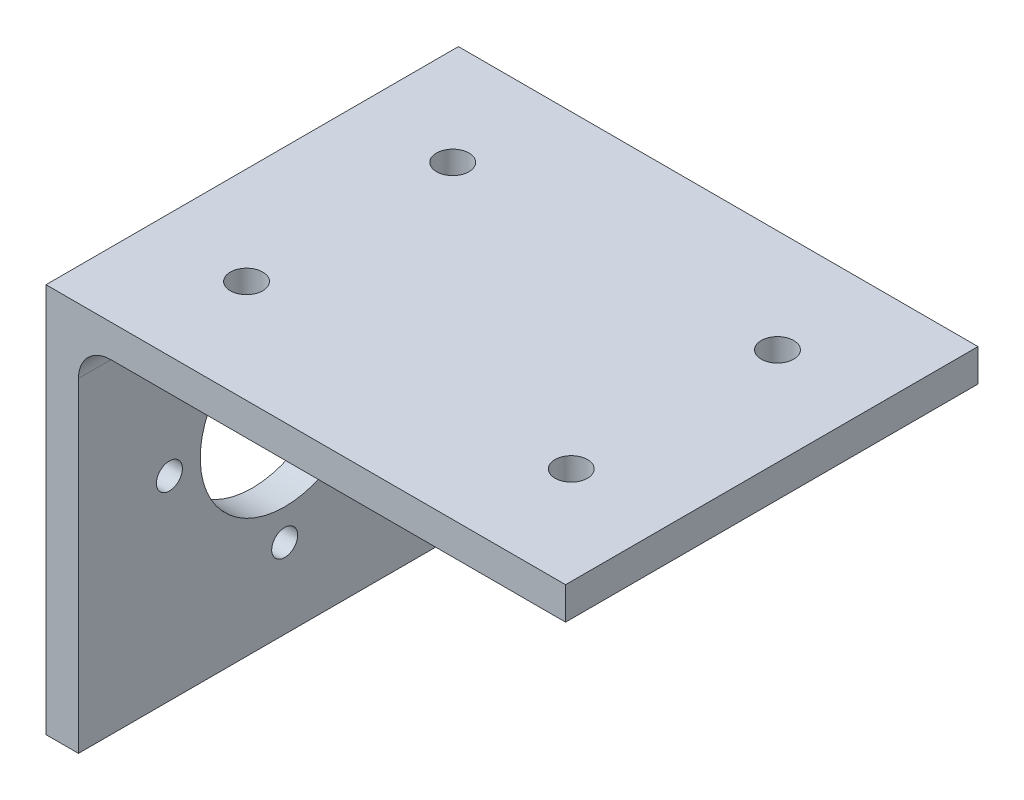
ISO-10303-21;
HEADER;
FILE_DESCRIPTION(('STEP AP214'),'2;1');
FILE_NAME('part.step','',(''),(''),'','','');
FILE_SCHEMA(('AUTOMOTIVE_DESIGN { 1 0 10303 214 1 1 1 1 }'));
ENDSEC;
DATA;
#1=APPLICATION_CONTEXT('core data for automotive mechanical design processes');
#2=APPLICATION_PROTOCOL_DEFINITION('international standard','automotive_design',2000,#1);
#3=PRODUCT_CONTEXT('',#1,'mechanical');
#4=PRODUCT('Part','Part','',(#3));
#5=PRODUCT_RELATED_PRODUCT_CATEGORY('part','',(#4));
#6=PRODUCT_DEFINITION_FORMATION('','',#4);
#7=PRODUCT_DEFINITION_CONTEXT('part definition',#1,'design');
#8=PRODUCT_DEFINITION('design','',#6,#7);
#9=PRODUCT_DEFINITION_SHAPE('','',#8);
#10=(LENGTH_UNIT() NAMED_UNIT(*) SI_UNIT(.MILLI.,.METRE.));
#11=(NAMED_UNIT(*) PLANE_ANGLE_UNIT() SI_UNIT($,.RADIAN.));
#12=(NAMED_UNIT(*) SI_UNIT($,.STERADIAN.) SOLID_ANGLE_UNIT());
#13=UNCERTAINTY_MEASURE_WITH_UNIT(LENGTH_MEASURE(1.E-05),#10,'distance_accuracy_value','');
#14=(GEOMETRIC_REPRESENTATION_CONTEXT(3) GLOBAL_UNCERTAINTY_ASSIGNED_CONTEXT((#13)) GLOBAL_UNIT_ASSIGNED_CONTEXT((#10,
#11,#12)) REPRESENTATION_CONTEXT('',''));
#15=CARTESIAN_POINT('',(0.,0.,0.));
#16=DIRECTION('',(0.,0.,1.));
#17=DIRECTION('',(1.,0.,0.));
#18=AXIS2_PLACEMENT_3D('',#15,#16,#17);
#19=CARTESIAN_POINT('',(5.,0.,63.5));
#20=DIRECTION('',(0.,1.,0.));
#21=DIRECTION('',(0.,0.,1.));
#22=AXIS2_PLACEMENT_3D('',#19,#20,#21);
#23=PLANE('',#22);
#24=DIRECTION('',(1.,0.,0.));
#25=VECTOR('',#24,1.);
#26=CARTESIAN_POINT('',(5.,0.,0.));
#27=LINE('',#26,#25);
#28=CARTESIAN_POINT('',(0.,0.,0.));
#29=VERTEX_POINT('',#28);
#30=CARTESIAN_POINT('',(5.,0.,0.));
#31=VERTEX_POINT('',#30);
#32=EDGE_CURVE('E123',#29,#31,#27,.T.);
#33=ORIENTED_EDGE('',*,*,#32,.T.);
#34=DIRECTION('',(0.,0.,-1.));
#35=VECTOR('',#34,1.);
#36=CARTESIAN_POINT('',(5.,0.,63.5));
#37=LINE('',#36,#35);
#38=CARTESIAN_POINT('',(5.,0.,63.5));
#39=VERTEX_POINT('',#38);
#40=EDGE_CURVE('E11',#39,#31,#37,.T.);
#41=ORIENTED_EDGE('',*,*,#40,.F.);
#42=DIRECTION('',(1.,0.,0.));
#43=VECTOR('',#42,1.);
#44=CARTESIAN_POINT('',(5.,0.,63.5));
#45=LINE('',#44,#43);
#46=CARTESIAN_POINT('',(0.,0.,63.5));
#47=VERTEX_POINT('',#46);
#48=EDGE_CURVE('E136',#47,#39,#45,.T.);
#49=ORIENTED_EDGE('',*,*,#48,.F.);
#50=DIRECTION('',(0.,0.,-1.));
#51=VECTOR('',#50,1.);
#52=CARTESIAN_POINT('',(0.,0.,63.5));
#53=LINE('',#52,#51);
#54=EDGE_CURVE('E119',#47,#29,#53,.T.);
#55=ORIENTED_EDGE('',*,*,#54,.T.);
#56=EDGE_LOOP('',(#33,#41,#49,#55));
#57=FACE_BOUND('',#56,.T.);
#58=ADVANCED_FACE('F33',(#57),#23,.F.);
#59=CARTESIAN_POINT('',(4.99999999999999,50.,63.5));
#60=DIRECTION('',(-1.,0.,0.));
#61=DIRECTION('',(0.,-1.,0.));
#62=AXIS2_PLACEMENT_3D('',#59,#60,#61);
#63=PLANE('',#62);
#64=CARTESIAN_POINT('',(5.,30.,49.5));
#65=DIRECTION('',(-1.,0.,0.));
#66=DIRECTION('',(0.,-1.,0.));
#67=AXIS2_PLACEMENT_3D('',#64,#65,#66);
#68=CIRCLE('',#67,2.);
#69=CARTESIAN_POINT('',(5.,28.,49.5));
#70=VERTEX_POINT('',#69);
#71=EDGE_CURVE('E162',#70,#70,#68,.T.);
#72=ORIENTED_EDGE('',*,*,#71,.T.);
#73=EDGE_LOOP('',(#72));
#74=FACE_BOUND('',#73,.T.);
#75=CARTESIAN_POINT('',(5.,12.25,31.75));
#76=DIRECTION('',(-1.,0.,0.));
#77=DIRECTION('',(0.,-1.,0.));
#78=AXIS2_PLACEMENT_3D('',#75,#76,#77);
#79=CIRCLE('',#78,2.00000000000001);
#80=CARTESIAN_POINT('',(5.,10.25,31.75));
#81=VERTEX_POINT('',#80);
#82=EDGE_CURVE('E168',#81,#81,#79,.T.);
#83=ORIENTED_EDGE('',*,*,#82,.T.);
#84=EDGE_LOOP('',(#83));
#85=FACE_BOUND('',#84,.T.);
#86=CARTESIAN_POINT('',(5.,30.,14.));
#87=DIRECTION('',(-1.,0.,0.));
#88=DIRECTION('',(0.,-1.,0.));
#89=AXIS2_PLACEMENT_3D('',#86,#87,#88);
#90=CIRCLE('',#89,2.00000000000001);
#91=CARTESIAN_POINT('',(5.,28.,14.));
#92=VERTEX_POINT('',#91);
#93=EDGE_CURVE('E169',#92,#92,#90,.T.);
#94=ORIENTED_EDGE('',*,*,#93,.T.);
#95=EDGE_LOOP('',(#94));
#96=FACE_BOUND('',#95,.T.);
#97=CARTESIAN_POINT('',(4.99999999999999,47.75,31.75));
#98=DIRECTION('',(-1.,0.,0.));
#99=DIRECTION('',(0.,-1.,0.));
#100=AXIS2_PLACEMENT_3D('',#97,#98,#99);
#101=CIRCLE('',#100,2.);
#102=CARTESIAN_POINT('',(4.99999999999999,45.75,31.75));
#103=VERTEX_POINT('',#102);
#104=EDGE_CURVE('E180',#103,#103,#101,.T.);
#105=ORIENTED_EDGE('',*,*,#104,.T.);
#106=EDGE_LOOP('',(#105));
#107=FACE_BOUND('',#106,.T.);
#108=CARTESIAN_POINT('',(5.,30.,31.75));
#109=DIRECTION('',(-1.,0.,0.));
#110=DIRECTION('',(0.,-1.,0.));
#111=AXIS2_PLACEMENT_3D('',#108,#109,#110);
#112=CIRCLE('',#111,13.);
#113=CARTESIAN_POINT('',(5.,17.,31.75));
#114=VERTEX_POINT('',#113);
#115=EDGE_CURVE('E127',#114,#114,#112,.T.);
#116=ORIENTED_EDGE('',*,*,#115,.T.);
#117=EDGE_LOOP('',(#116));
#118=FACE_BOUND('',#117,.T.);
#119=DIRECTION('',(0.,1.,0.));
#120=VECTOR('',#119,1.);
#121=CARTESIAN_POINT('',(4.99999999999999,50.,0.));
#122=LINE('',#121,#120);
#123=CARTESIAN_POINT('',(4.99999999999999,50.,0.));
#124=VERTEX_POINT('',#123);
#125=EDGE_CURVE('E126',#31,#124,#122,.T.);
#126=ORIENTED_EDGE('',*,*,#125,.T.);
#127=DIRECTION('',(0.,0.,-1.));
#128=VECTOR('',#127,1.);
#129=CARTESIAN_POINT('',(4.99999999999999,50.,63.5));
#130=LINE('',#129,#128);
#131=CARTESIAN_POINT('',(4.99999999999999,50.,63.5));
#132=VERTEX_POINT('',#131);
#133=EDGE_CURVE('E41',#132,#124,#130,.T.);
#134=ORIENTED_EDGE('',*,*,#133,.F.);
#135=DIRECTION('',(0.,1.,0.));
#136=VECTOR('',#135,1.);
#137=CARTESIAN_POINT('',(4.99999999999999,50.,63.5));
#138=LINE('',#137,#136);
#139=EDGE_CURVE('E89',#39,#132,#138,.T.);
#140=ORIENTED_EDGE('',*,*,#139,.F.);
#141=ORIENTED_EDGE('',*,*,#40,.T.);
#142=EDGE_LOOP('',(#126,#134,#140,#141));
#143=FACE_BOUND('',#142,.T.);
#144=ADVANCED_FACE('F244',(#74,#85,#96,#107,#118,#143),#63,.F.);
#145=CARTESIAN_POINT('',(9.99999999999998,50.,63.5));
#146=DIRECTION('',(0.,0.,-1.));
#147=DIRECTION('',(-1.,0.,0.));
#148=AXIS2_PLACEMENT_3D('',#145,#146,#147);
#149=CYLINDRICAL_SURFACE('',#148,4.99999999999999);
#150=CARTESIAN_POINT('',(9.99999999999998,50.,0.));
#151=DIRECTION('',(0.,0.,-1.));
#152=DIRECTION('',(1.,0.,0.));
#153=AXIS2_PLACEMENT_3D('',#150,#151,#152);
#154=CIRCLE('',#153,4.99999999999999);
#155=CARTESIAN_POINT('',(9.99999999999998,55.,0.));
#156=VERTEX_POINT('',#155);
#157=EDGE_CURVE('E129',#124,#156,#154,.T.);
#158=ORIENTED_EDGE('',*,*,#157,.T.);
#159=DIRECTION('',(0.,0.,-1.));
#160=VECTOR('',#159,1.);
#161=CARTESIAN_POINT('',(9.99999999999998,55.,63.5));
#162=LINE('',#161,#160);
#163=CARTESIAN_POINT('',(9.99999999999998,55.,63.5));
#164=VERTEX_POINT('',#163);
#165=EDGE_CURVE('E140',#164,#156,#162,.T.);
#166=ORIENTED_EDGE('',*,*,#165,.F.);
#167=CARTESIAN_POINT('',(9.99999999999998,50.,63.5));
#168=DIRECTION('',(0.,0.,-1.));
#169=DIRECTION('',(1.,0.,0.));
#170=AXIS2_PLACEMENT_3D('',#167,#168,#169);
#171=CIRCLE('',#170,4.99999999999999);
#172=EDGE_CURVE('E148',#132,#164,#171,.T.);
#173=ORIENTED_EDGE('',*,*,#172,.F.);
#174=ORIENTED_EDGE('',*,*,#133,.T.);
#175=EDGE_LOOP('',(#158,#166,#173,#174));
#176=FACE_BOUND('',#175,.T.);
#177=ADVANCED_FACE('F146',(#176),#149,.F.);
#178=CARTESIAN_POINT('',(80.,55.,63.5));
#179=DIRECTION('',(0.,1.,0.));
#180=DIRECTION('',(-1.,0.,0.));
#181=AXIS2_PLACEMENT_3D('',#178,#179,#180);
#182=PLANE('',#181);
#183=CARTESIAN_POINT('',(15.,55.,47.625));
#184=DIRECTION('',(0.,1.,0.));
#185=DIRECTION('',(0.,0.,-1.));
#186=AXIS2_PLACEMENT_3D('',#183,#184,#185);
#187=CIRCLE('',#186,2.5);
#188=CARTESIAN_POINT('',(15.,55.,45.125));
#189=VERTEX_POINT('',#188);
#190=EDGE_CURVE('E198',#189,#189,#187,.T.);
#191=ORIENTED_EDGE('',*,*,#190,.T.);
#192=EDGE_LOOP('',(#191));
#193=FACE_BOUND('',#192,.T.);
#194=CARTESIAN_POINT('',(65.,55.,47.625));
#195=DIRECTION('',(0.,1.,0.));
#196=DIRECTION('',(0.,0.,1.));
#197=AXIS2_PLACEMENT_3D('',#194,#195,#196);
#198=CIRCLE('',#197,2.50000000000001);
#199=CARTESIAN_POINT('',(65.,55.,50.125));
#200=VERTEX_POINT('',#199);
#201=EDGE_CURVE('E204',#200,#200,#198,.T.);
#202=ORIENTED_EDGE('',*,*,#201,.T.);
#203=EDGE_LOOP('',(#202));
#204=FACE_BOUND('',#203,.T.);
#205=CARTESIAN_POINT('',(65.,55.,15.875));
#206=DIRECTION('',(0.,1.,0.));
#207=DIRECTION('',(0.,0.,-1.));
#208=AXIS2_PLACEMENT_3D('',#205,#206,#207);
#209=CIRCLE('',#208,2.49999999999999);
#210=CARTESIAN_POINT('',(65.,55.,13.375));
#211=VERTEX_POINT('',#210);
#212=EDGE_CURVE('E192',#211,#211,#209,.T.);
#213=ORIENTED_EDGE('',*,*,#212,.T.);
#214=EDGE_LOOP('',(#213));
#215=FACE_BOUND('',#214,.T.);
#216=CARTESIAN_POINT('',(15.,55.,15.875));
#217=DIRECTION('',(0.,1.,0.));
#218=DIRECTION('',(0.,0.,1.));
#219=AXIS2_PLACEMENT_3D('',#216,#217,#218);
#220=CIRCLE('',#219,2.5);
#221=CARTESIAN_POINT('',(15.,55.,18.375));
#222=VERTEX_POINT('',#221);
#223=EDGE_CURVE('E181',#222,#222,#220,.T.);
#224=ORIENTED_EDGE('',*,*,#223,.T.);
#225=EDGE_LOOP('',(#224));
#226=FACE_BOUND('',#225,.T.);
#227=DIRECTION('',(1.,0.,0.));
#228=VECTOR('',#227,1.);
#229=CARTESIAN_POINT('',(80.,55.,0.));
#230=LINE('',#229,#228);
#231=CARTESIAN_POINT('',(80.,55.,0.));
#232=VERTEX_POINT('',#231);
#233=EDGE_CURVE('E131',#156,#232,#230,.T.);
#234=ORIENTED_EDGE('',*,*,#233,.T.);
#235=DIRECTION('',(0.,0.,-1.));
#236=VECTOR('',#235,1.);
#237=CARTESIAN_POINT('',(80.,55.,63.5));
#238=LINE('',#237,#236);
#239=CARTESIAN_POINT('',(80.,55.,63.5));
#240=VERTEX_POINT('',#239);
#241=EDGE_CURVE('E114',#240,#232,#238,.T.);
#242=ORIENTED_EDGE('',*,*,#241,.F.);
#243=DIRECTION('',(1.,0.,0.));
#244=VECTOR('',#243,1.);
#245=CARTESIAN_POINT('',(80.,55.,63.5));
#246=LINE('',#245,#244);
#247=EDGE_CURVE('E105',#164,#240,#246,.T.);
#248=ORIENTED_EDGE('',*,*,#247,.F.);
#249=ORIENTED_EDGE('',*,*,#165,.T.);
#250=EDGE_LOOP('',(#234,#242,#248,#249));
#251=FACE_BOUND('',#250,.T.);
#252=ADVANCED_FACE('F154',(#193,#204,#215,#226,#251),#182,.F.);
#253=CARTESIAN_POINT('',(80.,60.,63.5));
#254=DIRECTION('',(-1.,0.,0.));
#255=DIRECTION('',(0.,0.,1.));
#256=AXIS2_PLACEMENT_3D('',#253,#254,#255);
#257=PLANE('',#256);
#258=DIRECTION('',(0.,1.,0.));
#259=VECTOR('',#258,1.);
#260=CARTESIAN_POINT('',(80.,60.,0.));
#261=LINE('',#260,#259);
#262=CARTESIAN_POINT('',(80.,60.,0.));
#263=VERTEX_POINT('',#262);
#264=EDGE_CURVE('E113',#232,#263,#261,.T.);
#265=ORIENTED_EDGE('',*,*,#264,.T.);
#266=DIRECTION('',(0.,0.,-1.));
#267=VECTOR('',#266,1.);
#268=CARTESIAN_POINT('',(80.,60.,63.5));
#269=LINE('',#268,#267);
#270=CARTESIAN_POINT('',(80.,60.,63.5));
#271=VERTEX_POINT('',#270);
#272=EDGE_CURVE('E110',#271,#263,#269,.T.);
#273=ORIENTED_EDGE('',*,*,#272,.F.);
#274=DIRECTION('',(0.,1.,0.));
#275=VECTOR('',#274,1.);
#276=CARTESIAN_POINT('',(80.,60.,63.5));
#277=LINE('',#276,#275);
#278=EDGE_CURVE('E99',#240,#271,#277,.T.);
#279=ORIENTED_EDGE('',*,*,#278,.F.);
#280=ORIENTED_EDGE('',*,*,#241,.T.);
#281=EDGE_LOOP('',(#265,#273,#279,#280));
#282=FACE_BOUND('',#281,.T.);
#283=ADVANCED_FACE('F111',(#282),#257,.F.);
#284=CARTESIAN_POINT('',(0.,60.,63.5));
#285=DIRECTION('',(0.,-1.,0.));
#286=DIRECTION('',(0.,0.,-1.));
#287=AXIS2_PLACEMENT_3D('',#284,#285,#286);
#288=PLANE('',#287);
#289=CARTESIAN_POINT('',(15.,60.,47.625));
#290=DIRECTION('',(0.,1.,0.));
#291=DIRECTION('',(0.,0.,-1.));
#292=AXIS2_PLACEMENT_3D('',#289,#290,#291);
#293=CIRCLE('',#292,2.5);
#294=CARTESIAN_POINT('',(15.,60.,45.125));
#295=VERTEX_POINT('',#294);
#296=EDGE_CURVE('E195',#295,#295,#293,.T.);
#297=ORIENTED_EDGE('',*,*,#296,.F.);
#298=EDGE_LOOP('',(#297));
#299=FACE_BOUND('',#298,.T.);
#300=CARTESIAN_POINT('',(65.,60.,47.625));
#301=DIRECTION('',(0.,1.,0.));
#302=DIRECTION('',(0.,0.,1.));
#303=AXIS2_PLACEMENT_3D('',#300,#301,#302);
#304=CIRCLE('',#303,2.50000000000001);
#305=CARTESIAN_POINT('',(65.,60.,50.125));
#306=VERTEX_POINT('',#305);
#307=EDGE_CURVE('E201',#306,#306,#304,.T.);
#308=ORIENTED_EDGE('',*,*,#307,.F.);
#309=EDGE_LOOP('',(#308));
#310=FACE_BOUND('',#309,.T.);
#311=CARTESIAN_POINT('',(65.,60.,15.875));
#312=DIRECTION('',(0.,1.,0.));
#313=DIRECTION('',(0.,0.,-1.));
#314=AXIS2_PLACEMENT_3D('',#311,#312,#313);
#315=CIRCLE('',#314,2.49999999999999);
#316=CARTESIAN_POINT('',(65.,60.,13.375));
#317=VERTEX_POINT('',#316);
#318=EDGE_CURVE('E207',#317,#317,#315,.T.);
#319=ORIENTED_EDGE('',*,*,#318,.F.);
#320=EDGE_LOOP('',(#319));
#321=FACE_BOUND('',#320,.T.);
#322=CARTESIAN_POINT('',(15.,60.,15.875));
#323=DIRECTION('',(0.,1.,0.));
#324=DIRECTION('',(0.,0.,1.));
#325=AXIS2_PLACEMENT_3D('',#322,#323,#324);
#326=CIRCLE('',#325,2.5);
#327=CARTESIAN_POINT('',(15.,60.,18.375));
#328=VERTEX_POINT('',#327);
#329=EDGE_CURVE('E189',#328,#328,#326,.T.);
#330=ORIENTED_EDGE('',*,*,#329,.F.);
#331=EDGE_LOOP('',(#330));
#332=FACE_BOUND('',#331,.T.);
#333=DIRECTION('',(-1.,0.,0.));
#334=VECTOR('',#333,1.);
#335=CARTESIAN_POINT('',(0.,60.,0.));
#336=LINE('',#335,#334);
#337=CARTESIAN_POINT('',(0.,60.,0.));
#338=VERTEX_POINT('',#337);
#339=EDGE_CURVE('E75',#263,#338,#336,.T.);
#340=ORIENTED_EDGE('',*,*,#339,.T.);
#341=DIRECTION('',(0.,0.,-1.));
#342=VECTOR('',#341,1.);
#343=CARTESIAN_POINT('',(0.,60.,63.5));
#344=LINE('',#343,#342);
#345=CARTESIAN_POINT('',(0.,60.,63.5));
#346=VERTEX_POINT('',#345);
#347=EDGE_CURVE('E115',#346,#338,#344,.T.);
#348=ORIENTED_EDGE('',*,*,#347,.F.);
#349=DIRECTION('',(-1.,0.,0.));
#350=VECTOR('',#349,1.);
#351=CARTESIAN_POINT('',(0.,60.,63.5));
#352=LINE('',#351,#350);
#353=EDGE_CURVE('E103',#271,#346,#352,.T.);
#354=ORIENTED_EDGE('',*,*,#353,.F.);
#355=ORIENTED_EDGE('',*,*,#272,.T.);
#356=EDGE_LOOP('',(#340,#348,#354,#355));
#357=FACE_BOUND('',#356,.T.);
#358=ADVANCED_FACE('F117',(#299,#310,#321,#332,#357),#288,.F.);
#359=CARTESIAN_POINT('',(0.,0.,63.5));
#360=DIRECTION('',(1.,0.,0.));
#361=DIRECTION('',(0.,1.,0.));
#362=AXIS2_PLACEMENT_3D('',#359,#360,#361);
#363=PLANE('',#362);
#364=CARTESIAN_POINT('',(0.,30.,49.5));
#365=DIRECTION('',(-1.,0.,0.));
#366=DIRECTION('',(0.,-1.,0.));
#367=AXIS2_PLACEMENT_3D('',#364,#365,#366);
#368=CIRCLE('',#367,2.);
#369=CARTESIAN_POINT('',(0.,28.,49.5));
#370=VERTEX_POINT('',#369);
#371=EDGE_CURVE('E172',#370,#370,#368,.T.);
#372=ORIENTED_EDGE('',*,*,#371,.F.);
#373=EDGE_LOOP('',(#372));
#374=FACE_BOUND('',#373,.T.);
#375=CARTESIAN_POINT('',(0.,12.25,31.75));
#376=DIRECTION('',(-1.,0.,0.));
#377=DIRECTION('',(0.,-1.,0.));
#378=AXIS2_PLACEMENT_3D('',#375,#376,#377);
#379=CIRCLE('',#378,2.00000000000001);
#380=CARTESIAN_POINT('',(0.,10.25,31.75));
#381=VERTEX_POINT('',#380);
#382=EDGE_CURVE('E165',#381,#381,#379,.T.);
#383=ORIENTED_EDGE('',*,*,#382,.F.);
#384=EDGE_LOOP('',(#383));
#385=FACE_BOUND('',#384,.T.);
#386=CARTESIAN_POINT('',(0.,30.,14.));
#387=DIRECTION('',(-1.,0.,0.));
#388=DIRECTION('',(0.,-1.,0.));
#389=AXIS2_PLACEMENT_3D('',#386,#387,#388);
#390=CIRCLE('',#389,2.00000000000001);
#391=CARTESIAN_POINT('',(0.,28.,14.));
#392=VERTEX_POINT('',#391);
#393=EDGE_CURVE('E184',#392,#392,#390,.T.);
#394=ORIENTED_EDGE('',*,*,#393,.F.);
#395=EDGE_LOOP('',(#394));
#396=FACE_BOUND('',#395,.T.);
#397=CARTESIAN_POINT('',(0.,47.75,31.75));
#398=DIRECTION('',(-1.,0.,0.));
#399=DIRECTION('',(0.,-1.,0.));
#400=AXIS2_PLACEMENT_3D('',#397,#398,#399);
#401=CIRCLE('',#400,2.);
#402=CARTESIAN_POINT('',(0.,45.75,31.75));
#403=VERTEX_POINT('',#402);
#404=EDGE_CURVE('E177',#403,#403,#401,.T.);
#405=ORIENTED_EDGE('',*,*,#404,.F.);
#406=EDGE_LOOP('',(#405));
#407=FACE_BOUND('',#406,.T.);
#408=CARTESIAN_POINT('',(0.,30.,31.75));
#409=DIRECTION('',(-1.,0.,0.));
#410=DIRECTION('',(0.,-1.,0.));
#411=AXIS2_PLACEMENT_3D('',#408,#409,#410);
#412=CIRCLE('',#411,13.);
#413=CARTESIAN_POINT('',(0.,17.,31.75));
#414=VERTEX_POINT('',#413);
#415=EDGE_CURVE('E159',#414,#414,#412,.T.);
#416=ORIENTED_EDGE('',*,*,#415,.F.);
#417=EDGE_LOOP('',(#416));
#418=FACE_BOUND('',#417,.T.);
#419=DIRECTION('',(0.,-1.,0.));
#420=VECTOR('',#419,1.);
#421=CARTESIAN_POINT('',(0.,0.,0.));
#422=LINE('',#421,#420);
#423=EDGE_CURVE('E81',#338,#29,#422,.T.);
#424=ORIENTED_EDGE('',*,*,#423,.T.);
#425=ORIENTED_EDGE('',*,*,#54,.F.);
#426=DIRECTION('',(0.,-1.,0.));
#427=VECTOR('',#426,1.);
#428=CARTESIAN_POINT('',(0.,0.,63.5));
#429=LINE('',#428,#427);
#430=EDGE_CURVE('E49',#346,#47,#429,.T.);
#431=ORIENTED_EDGE('',*,*,#430,.F.);
#432=ORIENTED_EDGE('',*,*,#347,.T.);
#433=EDGE_LOOP('',(#424,#425,#431,#432));
#434=FACE_BOUND('',#433,.T.);
#435=ADVANCED_FACE('F225',(#374,#385,#396,#407,#418,#434),#363,.F.);
#436=CARTESIAN_POINT('',(9.99999999999998,50.,63.5));
#437=DIRECTION('',(0.,0.,1.));
#438=DIRECTION('',(1.,0.,0.));
#439=AXIS2_PLACEMENT_3D('',#436,#437,#438);
#440=PLANE('',#439);
#441=ORIENTED_EDGE('',*,*,#48,.T.);
#442=ORIENTED_EDGE('',*,*,#139,.T.);
#443=ORIENTED_EDGE('',*,*,#172,.T.);
#444=ORIENTED_EDGE('',*,*,#247,.T.);
#445=ORIENTED_EDGE('',*,*,#278,.T.);
#446=ORIENTED_EDGE('',*,*,#353,.T.);
#447=ORIENTED_EDGE('',*,*,#430,.T.);
#448=EDGE_LOOP('',(#441,#442,#443,#444,#445,#446,#447));
#449=FACE_BOUND('',#448,.T.);
#450=ADVANCED_FACE('F101',(#449),#440,.T.);
#451=CARTESIAN_POINT('',(9.99999999999998,50.,0.));
#452=DIRECTION('',(0.,0.,1.));
#453=DIRECTION('',(1.,0.,0.));
#454=AXIS2_PLACEMENT_3D('',#451,#452,#453);
#455=PLANE('',#454);
#456=ORIENTED_EDGE('',*,*,#32,.F.);
#457=ORIENTED_EDGE('',*,*,#423,.F.);
#458=ORIENTED_EDGE('',*,*,#339,.F.);
#459=ORIENTED_EDGE('',*,*,#264,.F.);
#460=ORIENTED_EDGE('',*,*,#233,.F.);
#461=ORIENTED_EDGE('',*,*,#157,.F.);
#462=ORIENTED_EDGE('',*,*,#125,.F.);
#463=EDGE_LOOP('',(#456,#457,#458,#459,#460,#461,#462));
#464=FACE_BOUND('',#463,.T.);
#465=ADVANCED_FACE('F152',(#464),#455,.F.);
#466=CARTESIAN_POINT('',(5.,30.,31.75));
#467=DIRECTION('',(-1.,0.,0.));
#468=DIRECTION('',(0.,-1.,0.));
#469=AXIS2_PLACEMENT_3D('',#466,#467,#468);
#470=CYLINDRICAL_SURFACE('',#469,13.);
#471=ORIENTED_EDGE('',*,*,#115,.F.);
#472=EDGE_LOOP('',(#471));
#473=FACE_BOUND('',#472,.T.);
#474=ORIENTED_EDGE('',*,*,#415,.T.);
#475=EDGE_LOOP('',(#474));
#476=FACE_BOUND('',#475,.T.);
#477=ADVANCED_FACE('F355',(#473,#476),#470,.F.);
#478=CARTESIAN_POINT('',(4.99999999999999,47.75,31.75));
#479=DIRECTION('',(-1.,0.,0.));
#480=DIRECTION('',(0.,-1.,0.));
#481=AXIS2_PLACEMENT_3D('',#478,#479,#480);
#482=CYLINDRICAL_SURFACE('',#481,2.);
#483=ORIENTED_EDGE('',*,*,#104,.F.);
#484=EDGE_LOOP('',(#483));
#485=FACE_BOUND('',#484,.T.);
#486=ORIENTED_EDGE('',*,*,#404,.T.);
#487=EDGE_LOOP('',(#486));
#488=FACE_BOUND('',#487,.T.);
#489=ADVANCED_FACE('F347',(#485,#488),#482,.F.);
#490=CARTESIAN_POINT('',(5.,30.,14.));
#491=DIRECTION('',(-1.,0.,0.));
#492=DIRECTION('',(0.,-1.,0.));
#493=AXIS2_PLACEMENT_3D('',#490,#491,#492);
#494=CYLINDRICAL_SURFACE('',#493,2.00000000000001);
#495=ORIENTED_EDGE('',*,*,#93,.F.);
#496=EDGE_LOOP('',(#495));
#497=FACE_BOUND('',#496,.T.);
#498=ORIENTED_EDGE('',*,*,#393,.T.);
#499=EDGE_LOOP('',(#498));
#500=FACE_BOUND('',#499,.T.);
#501=ADVANCED_FACE('F338',(#497,#500),#494,.F.);
#502=CARTESIAN_POINT('',(5.,12.25,31.75));
#503=DIRECTION('',(-1.,0.,0.));
#504=DIRECTION('',(0.,-1.,0.));
#505=AXIS2_PLACEMENT_3D('',#502,#503,#504);
#506=CYLINDRICAL_SURFACE('',#505,2.00000000000001);
#507=ORIENTED_EDGE('',*,*,#82,.F.);
#508=EDGE_LOOP('',(#507));
#509=FACE_BOUND('',#508,.T.);
#510=ORIENTED_EDGE('',*,*,#382,.T.);
#511=EDGE_LOOP('',(#510));
#512=FACE_BOUND('',#511,.T.);
#513=ADVANCED_FACE('F237',(#509,#512),#506,.F.);
#514=CARTESIAN_POINT('',(5.,30.,49.5));
#515=DIRECTION('',(-1.,0.,0.));
#516=DIRECTION('',(0.,-1.,0.));
#517=AXIS2_PLACEMENT_3D('',#514,#515,#516);
#518=CYLINDRICAL_SURFACE('',#517,2.);
#519=ORIENTED_EDGE('',*,*,#71,.F.);
#520=EDGE_LOOP('',(#519));
#521=FACE_BOUND('',#520,.T.);
#522=ORIENTED_EDGE('',*,*,#371,.T.);
#523=EDGE_LOOP('',(#522));
#524=FACE_BOUND('',#523,.T.);
#525=ADVANCED_FACE('F231',(#521,#524),#518,.F.);
#526=CARTESIAN_POINT('',(15.,55.,15.875));
#527=DIRECTION('',(0.,1.,0.));
#528=DIRECTION('',(0.,0.,1.));
#529=AXIS2_PLACEMENT_3D('',#526,#527,#528);
#530=CYLINDRICAL_SURFACE('',#529,2.5);
#531=ORIENTED_EDGE('',*,*,#223,.F.);
#532=EDGE_LOOP('',(#531));
#533=FACE_BOUND('',#532,.T.);
#534=ORIENTED_EDGE('',*,*,#329,.T.);
#535=EDGE_LOOP('',(#534));
#536=FACE_BOUND('',#535,.T.);
#537=ADVANCED_FACE('F219',(#533,#536),#530,.F.);
#538=CARTESIAN_POINT('',(65.,55.,15.875));
#539=DIRECTION('',(0.,1.,0.));
#540=DIRECTION('',(0.,0.,1.));
#541=AXIS2_PLACEMENT_3D('',#538,#539,#540);
#542=CYLINDRICAL_SURFACE('',#541,2.49999999999999);
#543=ORIENTED_EDGE('',*,*,#212,.F.);
#544=EDGE_LOOP('',(#543));
#545=FACE_BOUND('',#544,.T.);
#546=ORIENTED_EDGE('',*,*,#318,.T.);
#547=EDGE_LOOP('',(#546));
#548=FACE_BOUND('',#547,.T.);
#549=ADVANCED_FACE('F215',(#545,#548),#542,.F.);
#550=CARTESIAN_POINT('',(65.,55.,47.625));
#551=DIRECTION('',(0.,1.,0.));
#552=DIRECTION('',(0.,0.,1.));
#553=AXIS2_PLACEMENT_3D('',#550,#551,#552);
#554=CYLINDRICAL_SURFACE('',#553,2.50000000000001);
#555=ORIENTED_EDGE('',*,*,#201,.F.);
#556=EDGE_LOOP('',(#555));
#557=FACE_BOUND('',#556,.T.);
#558=ORIENTED_EDGE('',*,*,#307,.T.);
#559=EDGE_LOOP('',(#558));
#560=FACE_BOUND('',#559,.T.);
#561=ADVANCED_FACE('F218',(#557,#560),#554,.F.);
#562=CARTESIAN_POINT('',(15.,55.,47.625));
#563=DIRECTION('',(0.,1.,0.));
#564=DIRECTION('',(0.,0.,1.));
#565=AXIS2_PLACEMENT_3D('',#562,#563,#564);
#566=CYLINDRICAL_SURFACE('',#565,2.5);
#567=ORIENTED_EDGE('',*,*,#190,.F.);
#568=EDGE_LOOP('',(#567));
#569=FACE_BOUND('',#568,.T.);
#570=ORIENTED_EDGE('',*,*,#296,.T.);
#571=EDGE_LOOP('',(#570));
#572=FACE_BOUND('',#571,.T.);
#573=ADVANCED_FACE('F308',(#569,#572),#566,.F.);
#574=CLOSED_SHELL('',(#58,#144,#177,#252,#283,#358,#435,#450,#465,#477,#489,#501,#513,#525,#537,
#549,#561,#573));
#575=MANIFOLD_SOLID_BREP('B2',#574);
#576=ADVANCED_BREP_SHAPE_REPRESENTATION('',(#18,#575),#14);
#577=SHAPE_DEFINITION_REPRESENTATION(#9,#576);
ENDSEC;
END-ISO-10303-21;
